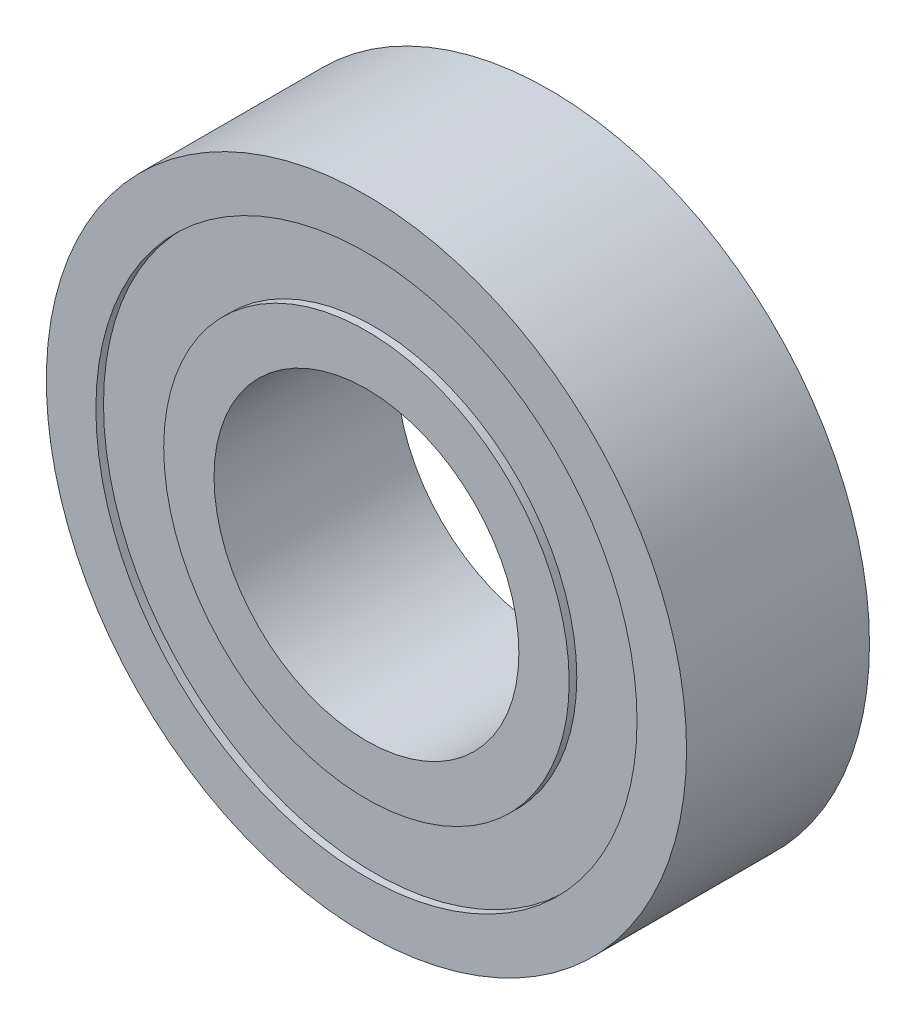
ISO-10303-21;
HEADER;
FILE_DESCRIPTION(('STEP AP214'),'2;1');
FILE_NAME('part.step','',(''),(''),'','','');
FILE_SCHEMA(('AUTOMOTIVE_DESIGN { 1 0 10303 214 1 1 1 1 }'));
ENDSEC;
DATA;
#1=APPLICATION_CONTEXT('core data for automotive mechanical design processes');
#2=APPLICATION_PROTOCOL_DEFINITION('international standard','automotive_design',2000,#1);
#3=PRODUCT_CONTEXT('',#1,'mechanical');
#4=PRODUCT('Part','Part','',(#3));
#5=PRODUCT_RELATED_PRODUCT_CATEGORY('part','',(#4));
#6=PRODUCT_DEFINITION_FORMATION('','',#4);
#7=PRODUCT_DEFINITION_CONTEXT('part definition',#1,'design');
#8=PRODUCT_DEFINITION('design','',#6,#7);
#9=PRODUCT_DEFINITION_SHAPE('','',#8);
#10=(LENGTH_UNIT() NAMED_UNIT(*) SI_UNIT(.MILLI.,.METRE.));
#11=(NAMED_UNIT(*) PLANE_ANGLE_UNIT() SI_UNIT($,.RADIAN.));
#12=(NAMED_UNIT(*) SI_UNIT($,.STERADIAN.) SOLID_ANGLE_UNIT());
#13=UNCERTAINTY_MEASURE_WITH_UNIT(LENGTH_MEASURE(1.E-05),#10,'distance_accuracy_value','');
#14=(GEOMETRIC_REPRESENTATION_CONTEXT(3) GLOBAL_UNCERTAINTY_ASSIGNED_CONTEXT((#13)) GLOBAL_UNIT_ASSIGNED_CONTEXT((#10,
#11,#12)) REPRESENTATION_CONTEXT('',''));
#15=CARTESIAN_POINT('',(0.,0.,0.));
#16=DIRECTION('',(0.,0.,1.));
#17=DIRECTION('',(1.,0.,0.));
#18=AXIS2_PLACEMENT_3D('',#15,#16,#17);
#19=CARTESIAN_POINT('',(0.,0.,-6.));
#20=DIRECTION('',(0.,0.,1.));
#21=DIRECTION('',(1.,0.,0.));
#22=AXIS2_PLACEMENT_3D('',#19,#20,#21);
#23=PLANE('',#22);
#24=CARTESIAN_POINT('',(0.,0.,-6.));
#25=DIRECTION('',(0.,0.,1.));
#26=DIRECTION('',(1.,0.,0.));
#27=AXIS2_PLACEMENT_3D('',#24,#25,#26);
#28=CIRCLE('',#27,10.);
#29=CARTESIAN_POINT('',(10.,0.,-6.));
#30=VERTEX_POINT('',#29);
#31=EDGE_CURVE('E46',#30,#30,#28,.T.);
#32=ORIENTED_EDGE('',*,*,#31,.T.);
#33=EDGE_LOOP('',(#32));
#34=FACE_BOUND('',#33,.T.);
#35=CARTESIAN_POINT('',(0.,0.,-6.));
#36=DIRECTION('',(0.,0.,1.));
#37=DIRECTION('',(1.,0.,0.));
#38=AXIS2_PLACEMENT_3D('',#35,#36,#37);
#39=CIRCLE('',#38,13.3);
#40=CARTESIAN_POINT('',(13.3,0.,-6.));
#41=VERTEX_POINT('',#40);
#42=EDGE_CURVE('E72',#41,#41,#39,.T.);
#43=ORIENTED_EDGE('',*,*,#42,.F.);
#44=EDGE_LOOP('',(#43));
#45=FACE_BOUND('',#44,.T.);
#46=ADVANCED_FACE('F35',(#34,#45),#23,.F.);
#47=CARTESIAN_POINT('',(0.,0.,6.));
#48=DIRECTION('',(0.,0.,1.));
#49=DIRECTION('',(1.,0.,0.));
#50=AXIS2_PLACEMENT_3D('',#47,#48,#49);
#51=PLANE('',#50);
#52=CARTESIAN_POINT('',(0.,0.,6.));
#53=DIRECTION('',(0.,0.,1.));
#54=DIRECTION('',(1.,0.,0.));
#55=AXIS2_PLACEMENT_3D('',#52,#53,#54);
#56=CIRCLE('',#55,10.);
#57=CARTESIAN_POINT('',(10.,0.,6.));
#58=VERTEX_POINT('',#57);
#59=EDGE_CURVE('E48',#58,#58,#56,.T.);
#60=ORIENTED_EDGE('',*,*,#59,.F.);
#61=EDGE_LOOP('',(#60));
#62=FACE_BOUND('',#61,.T.);
#63=CARTESIAN_POINT('',(0.,0.,6.));
#64=DIRECTION('',(0.,0.,1.));
#65=DIRECTION('',(1.,0.,0.));
#66=AXIS2_PLACEMENT_3D('',#63,#64,#65);
#67=CIRCLE('',#66,13.3);
#68=CARTESIAN_POINT('',(13.3,0.,6.));
#69=VERTEX_POINT('',#68);
#70=EDGE_CURVE('E60',#69,#69,#67,.T.);
#71=ORIENTED_EDGE('',*,*,#70,.T.);
#72=EDGE_LOOP('',(#71));
#73=FACE_BOUND('',#72,.T.);
#74=ADVANCED_FACE('F88',(#62,#73),#51,.T.);
#75=CARTESIAN_POINT('',(0.,0.,6.));
#76=DIRECTION('',(0.,0.,-1.));
#77=DIRECTION('',(-1.,0.,0.));
#78=AXIS2_PLACEMENT_3D('',#75,#76,#77);
#79=CYLINDRICAL_SURFACE('',#78,21.);
#80=CARTESIAN_POINT('',(0.,0.,6.));
#81=DIRECTION('',(0.,0.,1.));
#82=DIRECTION('',(1.,0.,0.));
#83=AXIS2_PLACEMENT_3D('',#80,#81,#82);
#84=CIRCLE('',#83,21.);
#85=CARTESIAN_POINT('',(21.,0.,6.));
#86=VERTEX_POINT('',#85);
#87=EDGE_CURVE('E10',#86,#86,#84,.T.);
#88=ORIENTED_EDGE('',*,*,#87,.F.);
#89=EDGE_LOOP('',(#88));
#90=FACE_BOUND('',#89,.T.);
#91=CARTESIAN_POINT('',(0.,0.,-6.));
#92=DIRECTION('',(0.,0.,1.));
#93=DIRECTION('',(1.,0.,0.));
#94=AXIS2_PLACEMENT_3D('',#91,#92,#93);
#95=CIRCLE('',#94,21.);
#96=CARTESIAN_POINT('',(21.,0.,-6.));
#97=VERTEX_POINT('',#96);
#98=EDGE_CURVE('E39',#97,#97,#95,.T.);
#99=ORIENTED_EDGE('',*,*,#98,.T.);
#100=EDGE_LOOP('',(#99));
#101=FACE_BOUND('',#100,.T.);
#102=ADVANCED_FACE('F37',(#90,#101),#79,.T.);
#103=CARTESIAN_POINT('',(0.,0.,6.));
#104=DIRECTION('',(0.,0.,1.));
#105=DIRECTION('',(1.,0.,0.));
#106=AXIS2_PLACEMENT_3D('',#103,#104,#105);
#107=CIRCLE('',#106,17.75);
#108=CARTESIAN_POINT('',(17.75,0.,6.));
#109=VERTEX_POINT('',#108);
#110=EDGE_CURVE('E54',#109,#109,#107,.T.);
#111=ORIENTED_EDGE('',*,*,#110,.F.);
#112=EDGE_LOOP('',(#111));
#113=FACE_BOUND('',#112,.T.);
#114=ORIENTED_EDGE('',*,*,#87,.T.);
#115=EDGE_LOOP('',(#114));
#116=FACE_BOUND('',#115,.T.);
#117=ADVANCED_FACE('F96',(#113,#116),#51,.T.);
#118=CARTESIAN_POINT('',(0.,0.,-6.));
#119=DIRECTION('',(0.,0.,1.));
#120=DIRECTION('',(1.,0.,0.));
#121=AXIS2_PLACEMENT_3D('',#118,#119,#120);
#122=CIRCLE('',#121,17.75);
#123=CARTESIAN_POINT('',(17.75,0.,-6.));
#124=VERTEX_POINT('',#123);
#125=EDGE_CURVE('E66',#124,#124,#122,.T.);
#126=ORIENTED_EDGE('',*,*,#125,.T.);
#127=EDGE_LOOP('',(#126));
#128=FACE_BOUND('',#127,.T.);
#129=ORIENTED_EDGE('',*,*,#98,.F.);
#130=EDGE_LOOP('',(#129));
#131=FACE_BOUND('',#130,.T.);
#132=ADVANCED_FACE('F90',(#128,#131),#23,.F.);
#133=CARTESIAN_POINT('',(0.,0.,-6.));
#134=DIRECTION('',(0.,0.,1.));
#135=DIRECTION('',(1.,0.,0.));
#136=AXIS2_PLACEMENT_3D('',#133,#134,#135);
#137=CYLINDRICAL_SURFACE('',#136,10.);
#138=ORIENTED_EDGE('',*,*,#31,.F.);
#139=EDGE_LOOP('',(#138));
#140=FACE_BOUND('',#139,.T.);
#141=ORIENTED_EDGE('',*,*,#59,.T.);
#142=EDGE_LOOP('',(#141));
#143=FACE_BOUND('',#142,.T.);
#144=ADVANCED_FACE('F98',(#140,#143),#137,.F.);
#145=CARTESIAN_POINT('',(0.,0.,5.5));
#146=DIRECTION('',(0.,0.,1.));
#147=DIRECTION('',(1.,0.,0.));
#148=AXIS2_PLACEMENT_3D('',#145,#146,#147);
#149=CYLINDRICAL_SURFACE('',#148,17.75);
#150=CARTESIAN_POINT('',(0.,0.,5.5));
#151=DIRECTION('',(0.,0.,1.));
#152=DIRECTION('',(1.,0.,0.));
#153=AXIS2_PLACEMENT_3D('',#150,#151,#152);
#154=CIRCLE('',#153,17.75);
#155=CARTESIAN_POINT('',(17.75,0.,5.5));
#156=VERTEX_POINT('',#155);
#157=EDGE_CURVE('E51',#156,#156,#154,.T.);
#158=ORIENTED_EDGE('',*,*,#157,.F.);
#159=EDGE_LOOP('',(#158));
#160=FACE_BOUND('',#159,.T.);
#161=ORIENTED_EDGE('',*,*,#110,.T.);
#162=EDGE_LOOP('',(#161));
#163=FACE_BOUND('',#162,.T.);
#164=ADVANCED_FACE('F104',(#160,#163),#149,.F.);
#165=CARTESIAN_POINT('',(0.,0.,5.5));
#166=DIRECTION('',(0.,0.,1.));
#167=DIRECTION('',(1.,0.,0.));
#168=AXIS2_PLACEMENT_3D('',#165,#166,#167);
#169=PLANE('',#168);
#170=CARTESIAN_POINT('',(0.,0.,5.5));
#171=DIRECTION('',(0.,0.,1.));
#172=DIRECTION('',(1.,0.,0.));
#173=AXIS2_PLACEMENT_3D('',#170,#171,#172);
#174=CIRCLE('',#173,13.3);
#175=CARTESIAN_POINT('',(13.3,0.,5.5));
#176=VERTEX_POINT('',#175);
#177=EDGE_CURVE('E57',#176,#176,#174,.T.);
#178=ORIENTED_EDGE('',*,*,#177,.F.);
#179=EDGE_LOOP('',(#178));
#180=FACE_BOUND('',#179,.T.);
#181=ORIENTED_EDGE('',*,*,#157,.T.);
#182=EDGE_LOOP('',(#181));
#183=FACE_BOUND('',#182,.T.);
#184=ADVANCED_FACE('F135',(#180,#183),#169,.T.);
#185=CARTESIAN_POINT('',(0.,0.,5.5));
#186=DIRECTION('',(0.,0.,1.));
#187=DIRECTION('',(1.,0.,0.));
#188=AXIS2_PLACEMENT_3D('',#185,#186,#187);
#189=CYLINDRICAL_SURFACE('',#188,13.3);
#190=ORIENTED_EDGE('',*,*,#177,.T.);
#191=EDGE_LOOP('',(#190));
#192=FACE_BOUND('',#191,.T.);
#193=ORIENTED_EDGE('',*,*,#70,.F.);
#194=EDGE_LOOP('',(#193));
#195=FACE_BOUND('',#194,.T.);
#196=ADVANCED_FACE('F145',(#192,#195),#189,.T.);
#197=CARTESIAN_POINT('',(0.,0.,-5.5));
#198=DIRECTION('',(0.,0.,-1.));
#199=DIRECTION('',(1.,0.,0.));
#200=AXIS2_PLACEMENT_3D('',#197,#198,#199);
#201=PLANE('',#200);
#202=CARTESIAN_POINT('',(0.,0.,-5.5));
#203=DIRECTION('',(0.,0.,1.));
#204=DIRECTION('',(1.,0.,0.));
#205=AXIS2_PLACEMENT_3D('',#202,#203,#204);
#206=CIRCLE('',#205,17.75);
#207=CARTESIAN_POINT('',(17.75,0.,-5.5));
#208=VERTEX_POINT('',#207);
#209=EDGE_CURVE('E63',#208,#208,#206,.T.);
#210=ORIENTED_EDGE('',*,*,#209,.F.);
#211=EDGE_LOOP('',(#210));
#212=FACE_BOUND('',#211,.T.);
#213=CARTESIAN_POINT('',(0.,0.,-5.5));
#214=DIRECTION('',(0.,0.,1.));
#215=DIRECTION('',(1.,0.,0.));
#216=AXIS2_PLACEMENT_3D('',#213,#214,#215);
#217=CIRCLE('',#216,13.3);
#218=CARTESIAN_POINT('',(13.3,0.,-5.5));
#219=VERTEX_POINT('',#218);
#220=EDGE_CURVE('E69',#219,#219,#217,.T.);
#221=ORIENTED_EDGE('',*,*,#220,.T.);
#222=EDGE_LOOP('',(#221));
#223=FACE_BOUND('',#222,.T.);
#224=ADVANCED_FACE('F78',(#212,#223),#201,.T.);
#225=CARTESIAN_POINT('',(0.,0.,-5.5));
#226=DIRECTION('',(0.,0.,-1.));
#227=DIRECTION('',(-1.,0.,0.));
#228=AXIS2_PLACEMENT_3D('',#225,#226,#227);
#229=CYLINDRICAL_SURFACE('',#228,17.75);
#230=ORIENTED_EDGE('',*,*,#209,.T.);
#231=EDGE_LOOP('',(#230));
#232=FACE_BOUND('',#231,.T.);
#233=ORIENTED_EDGE('',*,*,#125,.F.);
#234=EDGE_LOOP('',(#233));
#235=FACE_BOUND('',#234,.T.);
#236=ADVANCED_FACE('F83',(#232,#235),#229,.F.);
#237=CARTESIAN_POINT('',(0.,0.,-5.5));
#238=DIRECTION('',(0.,0.,-1.));
#239=DIRECTION('',(-1.,0.,0.));
#240=AXIS2_PLACEMENT_3D('',#237,#238,#239);
#241=CYLINDRICAL_SURFACE('',#240,13.3);
#242=ORIENTED_EDGE('',*,*,#220,.F.);
#243=EDGE_LOOP('',(#242));
#244=FACE_BOUND('',#243,.T.);
#245=ORIENTED_EDGE('',*,*,#42,.T.);
#246=EDGE_LOOP('',(#245));
#247=FACE_BOUND('',#246,.T.);
#248=ADVANCED_FACE('F80',(#244,#247),#241,.T.);
#249=CLOSED_SHELL('',(#46,#74,#102,#117,#132,#144,#164,#184,#196,#224,#236,#248));
#250=MANIFOLD_SOLID_BREP('B2',#249);
#251=ADVANCED_BREP_SHAPE_REPRESENTATION('',(#18,#250),#14);
#252=SHAPE_DEFINITION_REPRESENTATION(#9,#251);
ENDSEC;
END-ISO-10303-21;
